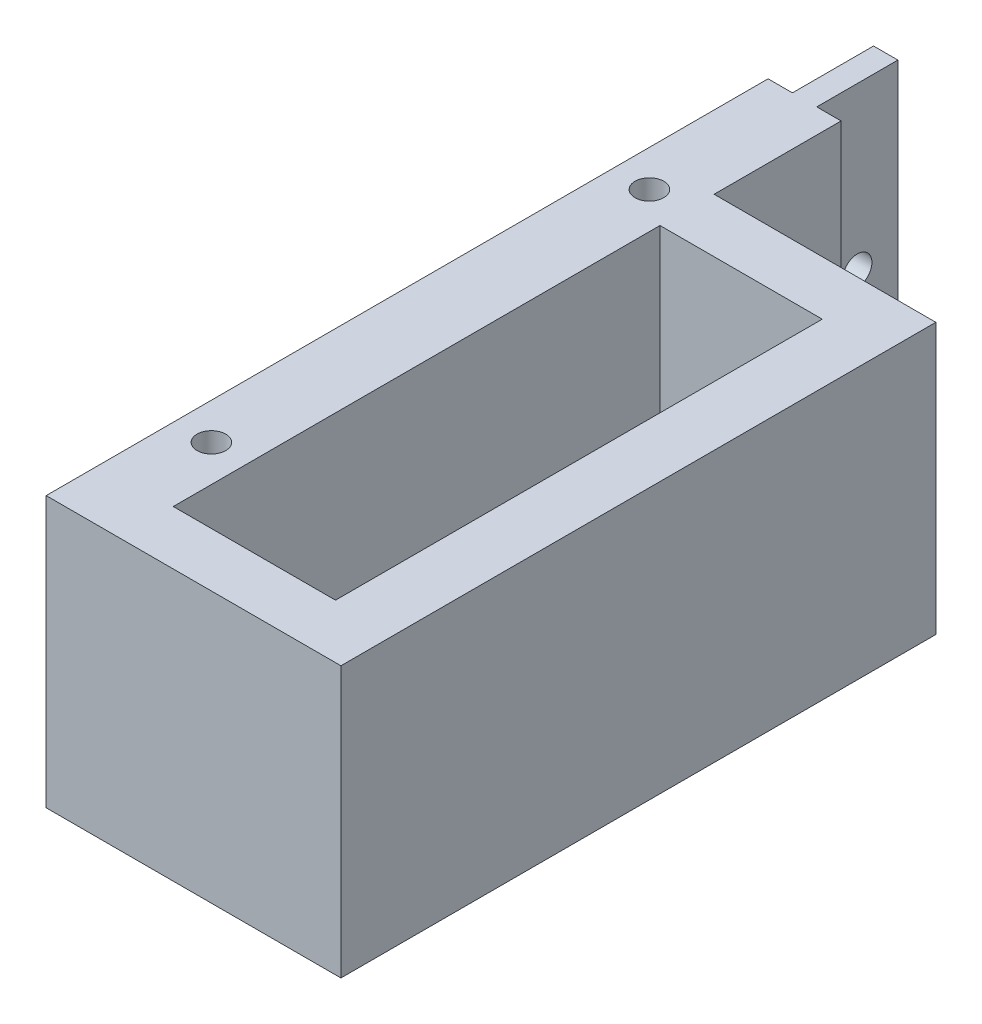
ISO-10303-21;
HEADER;
FILE_DESCRIPTION(('STEP AP214'),'2;1');
FILE_NAME('part.step','',(''),(''),'','','');
FILE_SCHEMA(('AUTOMOTIVE_DESIGN { 1 0 10303 214 1 1 1 1 }'));
ENDSEC;
DATA;
#1=APPLICATION_CONTEXT('core data for automotive mechanical design processes');
#2=APPLICATION_PROTOCOL_DEFINITION('international standard','automotive_design',2000,#1);
#3=PRODUCT_CONTEXT('',#1,'mechanical');
#4=PRODUCT('Part','Part','',(#3));
#5=PRODUCT_RELATED_PRODUCT_CATEGORY('part','',(#4));
#6=PRODUCT_DEFINITION_FORMATION('','',#4);
#7=PRODUCT_DEFINITION_CONTEXT('part definition',#1,'design');
#8=PRODUCT_DEFINITION('design','',#6,#7);
#9=PRODUCT_DEFINITION_SHAPE('','',#8);
#10=(LENGTH_UNIT() NAMED_UNIT(*) SI_UNIT(.MILLI.,.METRE.));
#11=(NAMED_UNIT(*) PLANE_ANGLE_UNIT() SI_UNIT($,.RADIAN.));
#12=(NAMED_UNIT(*) SI_UNIT($,.STERADIAN.) SOLID_ANGLE_UNIT());
#13=UNCERTAINTY_MEASURE_WITH_UNIT(LENGTH_MEASURE(1.E-05),#10,'distance_accuracy_value','');
#14=(GEOMETRIC_REPRESENTATION_CONTEXT(3) GLOBAL_UNCERTAINTY_ASSIGNED_CONTEXT((#13)) GLOBAL_UNIT_ASSIGNED_CONTEXT((#10,
#11,#12)) REPRESENTATION_CONTEXT('',''));
#15=CARTESIAN_POINT('',(0.,0.,0.));
#16=DIRECTION('',(0.,0.,1.));
#17=DIRECTION('',(1.,0.,0.));
#18=AXIS2_PLACEMENT_3D('',#15,#16,#17);
#19=CARTESIAN_POINT('',(-33.5,85.,-320.01));
#20=DIRECTION('',(0.,-1.,0.));
#21=DIRECTION('',(0.,0.,-1.));
#22=AXIS2_PLACEMENT_3D('',#19,#20,#21);
#23=PLANE('',#22);
#24=DIRECTION('',(0.,0.,1.));
#25=VECTOR('',#24,1.);
#26=CARTESIAN_POINT('',(-33.5,85.,0.));
#27=LINE('',#26,#25);
#28=CARTESIAN_POINT('',(-33.5,85.,186.515436219675));
#29=VERTEX_POINT('',#28);
#30=CARTESIAN_POINT('',(-33.5,85.,320.));
#31=VERTEX_POINT('',#30);
#32=EDGE_CURVE('E248',#29,#31,#27,.T.);
#33=ORIENTED_EDGE('',*,*,#32,.F.);
#34=DIRECTION('',(1.,0.,0.));
#35=VECTOR('',#34,1.);
#36=CARTESIAN_POINT('',(-29.,85.,186.515436219675));
#37=LINE('',#36,#35);
#38=CARTESIAN_POINT('',(-29.,85.,186.515436219675));
#39=VERTEX_POINT('',#38);
#40=EDGE_CURVE('E266',#29,#39,#37,.T.);
#41=ORIENTED_EDGE('',*,*,#40,.T.);
#42=DIRECTION('',(0.,0.,-1.));
#43=VECTOR('',#42,1.);
#44=CARTESIAN_POINT('',(-29.,85.,186.515436219675));
#45=LINE('',#44,#43);
#46=CARTESIAN_POINT('',(-29.,85.,171.515436219675));
#47=VERTEX_POINT('',#46);
#48=EDGE_CURVE('E254',#39,#47,#45,.T.);
#49=ORIENTED_EDGE('',*,*,#48,.T.);
#50=DIRECTION('',(1.,0.,0.));
#51=VECTOR('',#50,1.);
#52=CARTESIAN_POINT('',(-29.,85.,171.515436219675));
#53=LINE('',#52,#51);
#54=CARTESIAN_POINT('',(-24.5,85.,171.515436219675));
#55=VERTEX_POINT('',#54);
#56=EDGE_CURVE('E263',#47,#55,#53,.T.);
#57=ORIENTED_EDGE('',*,*,#56,.T.);
#58=DIRECTION('',(0.,0.,1.));
#59=VECTOR('',#58,1.);
#60=CARTESIAN_POINT('',(-24.5,85.,171.515436219675));
#61=LINE('',#60,#59);
#62=CARTESIAN_POINT('',(-24.5,85.,186.515436219675));
#63=VERTEX_POINT('',#62);
#64=EDGE_CURVE('E257',#55,#63,#61,.T.);
#65=ORIENTED_EDGE('',*,*,#64,.T.);
#66=DIRECTION('',(1.,0.,0.));
#67=VECTOR('',#66,1.);
#68=CARTESIAN_POINT('',(-24.5,85.,186.515436219675));
#69=LINE('',#68,#67);
#70=CARTESIAN_POINT('',(-20.,85.,186.515436219675));
#71=VERTEX_POINT('',#70);
#72=EDGE_CURVE('E260',#63,#71,#69,.T.);
#73=ORIENTED_EDGE('',*,*,#72,.T.);
#74=DIRECTION('',(0.,0.,-1.));
#75=VECTOR('',#74,1.);
#76=CARTESIAN_POINT('',(-20.,85.,0.));
#77=LINE('',#76,#75);
#78=CARTESIAN_POINT('',(-20.,85.,210.));
#79=VERTEX_POINT('',#78);
#80=EDGE_CURVE('E252',#79,#71,#77,.T.);
#81=ORIENTED_EDGE('',*,*,#80,.F.);
#82=DIRECTION('',(1.,0.,0.));
#83=VECTOR('',#82,1.);
#84=CARTESIAN_POINT('',(20.,85.,210.));
#85=LINE('',#84,#83);
#86=CARTESIAN_POINT('',(21.,85.,210.));
#87=VERTEX_POINT('',#86);
#88=EDGE_CURVE('E272',#79,#87,#85,.T.);
#89=ORIENTED_EDGE('',*,*,#88,.T.);
#90=DIRECTION('',(0.,0.,-1.));
#91=VECTOR('',#90,1.);
#92=CARTESIAN_POINT('',(21.,85.,0.));
#93=LINE('',#92,#91);
#94=CARTESIAN_POINT('',(21.,85.,320.));
#95=VERTEX_POINT('',#94);
#96=EDGE_CURVE('E250',#95,#87,#93,.T.);
#97=ORIENTED_EDGE('',*,*,#96,.F.);
#98=DIRECTION('',(-1.,0.,0.));
#99=VECTOR('',#98,1.);
#100=CARTESIAN_POINT('',(-33.5,85.,320.));
#101=LINE('',#100,#99);
#102=EDGE_CURVE('E163',#95,#31,#101,.T.);
#103=ORIENTED_EDGE('',*,*,#102,.T.);
#104=EDGE_LOOP('',(#33,#41,#49,#57,#65,#73,#81,#89,#97,#103));
#105=FACE_BOUND('',#104,.T.);
#106=DIRECTION('',(-1.,0.,0.));
#107=VECTOR('',#106,1.);
#108=CARTESIAN_POINT('',(-20.,85.,220.));
#109=LINE('',#108,#107);
#110=CARTESIAN_POINT('',(10.,85.,220.));
#111=VERTEX_POINT('',#110);
#112=CARTESIAN_POINT('',(-20.,85.,220.));
#113=VERTEX_POINT('',#112);
#114=EDGE_CURVE('E158',#111,#113,#109,.T.);
#115=ORIENTED_EDGE('',*,*,#114,.T.);
#116=DIRECTION('',(0.,0.,1.));
#117=VECTOR('',#116,1.);
#118=CARTESIAN_POINT('',(-20.,85.,220.));
#119=LINE('',#118,#117);
#120=CARTESIAN_POINT('',(-20.,85.,310.));
#121=VERTEX_POINT('',#120);
#122=EDGE_CURVE('E269',#113,#121,#119,.T.);
#123=ORIENTED_EDGE('',*,*,#122,.T.);
#124=DIRECTION('',(1.,0.,0.));
#125=VECTOR('',#124,1.);
#126=CARTESIAN_POINT('',(-20.,85.,310.));
#127=LINE('',#126,#125);
#128=CARTESIAN_POINT('',(10.,85.,310.));
#129=VERTEX_POINT('',#128);
#130=EDGE_CURVE('E168',#121,#129,#127,.T.);
#131=ORIENTED_EDGE('',*,*,#130,.T.);
#132=DIRECTION('',(0.,0.,-1.));
#133=VECTOR('',#132,1.);
#134=CARTESIAN_POINT('',(10.,85.,310.));
#135=LINE('',#134,#133);
#136=EDGE_CURVE('E148',#129,#111,#135,.T.);
#137=ORIENTED_EDGE('',*,*,#136,.T.);
#138=EDGE_LOOP('',(#115,#123,#131,#137));
#139=FACE_BOUND('',#138,.T.);
#140=CARTESIAN_POINT('',(-26.75,85.,215.21355987266));
#141=DIRECTION('',(0.,-1.,0.));
#142=DIRECTION('',(0.,0.,-1.));
#143=AXIS2_PLACEMENT_3D('',#140,#141,#142);
#144=CIRCLE('',#143,2.65);
#145=CARTESIAN_POINT('',(-26.75,85.,212.56355987266));
#146=VERTEX_POINT('',#145);
#147=EDGE_CURVE('E176',#146,#146,#144,.T.);
#148=ORIENTED_EDGE('',*,*,#147,.F.);
#149=EDGE_LOOP('',(#148));
#150=FACE_BOUND('',#149,.T.);
#151=CARTESIAN_POINT('',(-26.75,85.,296.200419438666));
#152=DIRECTION('',(0.,-1.,0.));
#153=DIRECTION('',(0.,0.,-1.));
#154=AXIS2_PLACEMENT_3D('',#151,#152,#153);
#155=CIRCLE('',#154,2.65);
#156=CARTESIAN_POINT('',(-26.75,85.,293.550419438666));
#157=VERTEX_POINT('',#156);
#158=EDGE_CURVE('E245',#157,#157,#155,.T.);
#159=ORIENTED_EDGE('',*,*,#158,.F.);
#160=EDGE_LOOP('',(#159));
#161=FACE_BOUND('',#160,.T.);
#162=ADVANCED_FACE('F38',(#105,#139,#150,#161),#23,.T.);
#163=CARTESIAN_POINT('',(-33.5,105.,179.015436219675));
#164=DIRECTION('',(1.,0.,0.));
#165=DIRECTION('',(0.,0.,-1.));
#166=AXIS2_PLACEMENT_3D('',#163,#164,#165);
#167=CYLINDRICAL_SURFACE('',#166,2.70000000000001);
#168=CARTESIAN_POINT('',(-29.,105.,179.015436219675));
#169=DIRECTION('',(1.,0.,0.));
#170=DIRECTION('',(0.,0.,-1.));
#171=AXIS2_PLACEMENT_3D('',#168,#169,#170);
#172=CIRCLE('',#171,2.70000000000001);
#173=CARTESIAN_POINT('',(-29.,105.,176.315436219675));
#174=VERTEX_POINT('',#173);
#175=EDGE_CURVE('E193',#174,#174,#172,.F.);
#176=ORIENTED_EDGE('',*,*,#175,.T.);
#177=EDGE_LOOP('',(#176));
#178=FACE_BOUND('',#177,.T.);
#179=CARTESIAN_POINT('',(-24.5,105.,179.015436219675));
#180=DIRECTION('',(-1.,0.,0.));
#181=DIRECTION('',(0.,0.,1.));
#182=AXIS2_PLACEMENT_3D('',#179,#180,#181);
#183=CIRCLE('',#182,2.70000000000001);
#184=CARTESIAN_POINT('',(-24.5,105.,181.715436219675));
#185=VERTEX_POINT('',#184);
#186=EDGE_CURVE('E211',#185,#185,#183,.F.);
#187=ORIENTED_EDGE('',*,*,#186,.T.);
#188=EDGE_LOOP('',(#187));
#189=FACE_BOUND('',#188,.T.);
#190=ADVANCED_FACE('F317',(#178,#189),#167,.F.);
#191=CARTESIAN_POINT('',(-29.,-135.01,186.515436219675));
#192=DIRECTION('',(1.,0.,0.));
#193=DIRECTION('',(0.,0.,-1.));
#194=AXIS2_PLACEMENT_3D('',#191,#192,#193);
#195=PLANE('',#194);
#196=ORIENTED_EDGE('',*,*,#175,.F.);
#197=EDGE_LOOP('',(#196));
#198=FACE_BOUND('',#197,.T.);
#199=ORIENTED_EDGE('',*,*,#48,.F.);
#200=DIRECTION('',(0.,1.,0.));
#201=VECTOR('',#200,1.);
#202=CARTESIAN_POINT('',(-29.,-135.01,186.515436219675));
#203=LINE('',#202,#201);
#204=CARTESIAN_POINT('',(-29.,135.,186.515436219675));
#205=VERTEX_POINT('',#204);
#206=EDGE_CURVE('E195',#39,#205,#203,.T.);
#207=ORIENTED_EDGE('',*,*,#206,.T.);
#208=DIRECTION('',(0.,0.,-1.));
#209=VECTOR('',#208,1.);
#210=CARTESIAN_POINT('',(-29.,135.,-320.));
#211=LINE('',#210,#209);
#212=CARTESIAN_POINT('',(-29.,135.,171.515436219675));
#213=VERTEX_POINT('',#212);
#214=EDGE_CURVE('E218',#205,#213,#211,.T.);
#215=ORIENTED_EDGE('',*,*,#214,.T.);
#216=DIRECTION('',(0.,1.,0.));
#217=VECTOR('',#216,1.);
#218=CARTESIAN_POINT('',(-29.,-135.01,171.515436219675));
#219=LINE('',#218,#217);
#220=EDGE_CURVE('E198',#47,#213,#219,.T.);
#221=ORIENTED_EDGE('',*,*,#220,.F.);
#222=EDGE_LOOP('',(#199,#207,#215,#221));
#223=FACE_BOUND('',#222,.T.);
#224=ADVANCED_FACE('F293',(#198,#223),#195,.F.);
#225=CARTESIAN_POINT('',(-29.,-135.01,171.515436219675));
#226=DIRECTION('',(0.,0.,1.));
#227=DIRECTION('',(0.,-1.,0.));
#228=AXIS2_PLACEMENT_3D('',#225,#226,#227);
#229=PLANE('',#228);
#230=ORIENTED_EDGE('',*,*,#56,.F.);
#231=ORIENTED_EDGE('',*,*,#220,.T.);
#232=DIRECTION('',(1.,0.,0.));
#233=VECTOR('',#232,1.);
#234=CARTESIAN_POINT('',(-10.,135.,171.515436219675));
#235=LINE('',#234,#233);
#236=CARTESIAN_POINT('',(-24.5,135.,171.515436219675));
#237=VERTEX_POINT('',#236);
#238=EDGE_CURVE('E221',#213,#237,#235,.T.);
#239=ORIENTED_EDGE('',*,*,#238,.T.);
#240=DIRECTION('',(0.,1.,0.));
#241=VECTOR('',#240,1.);
#242=CARTESIAN_POINT('',(-24.5,-135.01,171.515436219675));
#243=LINE('',#242,#241);
#244=EDGE_CURVE('E199',#55,#237,#243,.T.);
#245=ORIENTED_EDGE('',*,*,#244,.F.);
#246=EDGE_LOOP('',(#230,#231,#239,#245));
#247=FACE_BOUND('',#246,.T.);
#248=ADVANCED_FACE('F296',(#247),#229,.F.);
#249=CARTESIAN_POINT('',(-24.5,-135.01,171.515436219675));
#250=DIRECTION('',(-1.,0.,0.));
#251=DIRECTION('',(0.,0.,1.));
#252=AXIS2_PLACEMENT_3D('',#249,#250,#251);
#253=PLANE('',#252);
#254=ORIENTED_EDGE('',*,*,#186,.F.);
#255=EDGE_LOOP('',(#254));
#256=FACE_BOUND('',#255,.T.);
#257=ORIENTED_EDGE('',*,*,#64,.F.);
#258=ORIENTED_EDGE('',*,*,#244,.T.);
#259=DIRECTION('',(0.,0.,1.));
#260=VECTOR('',#259,1.);
#261=CARTESIAN_POINT('',(-24.5000000000001,135.,-320.));
#262=LINE('',#261,#260);
#263=CARTESIAN_POINT('',(-24.5,135.,186.515436219675));
#264=VERTEX_POINT('',#263);
#265=EDGE_CURVE('E224',#237,#264,#262,.T.);
#266=ORIENTED_EDGE('',*,*,#265,.T.);
#267=DIRECTION('',(0.,1.,0.));
#268=VECTOR('',#267,1.);
#269=CARTESIAN_POINT('',(-24.5,-135.01,186.515436219675));
#270=LINE('',#269,#268);
#271=EDGE_CURVE('E42',#63,#264,#270,.T.);
#272=ORIENTED_EDGE('',*,*,#271,.F.);
#273=EDGE_LOOP('',(#257,#258,#266,#272));
#274=FACE_BOUND('',#273,.T.);
#275=ADVANCED_FACE('F297',(#256,#274),#253,.F.);
#276=CARTESIAN_POINT('',(-24.5,-135.01,186.515436219675));
#277=DIRECTION('',(0.,0.,1.));
#278=DIRECTION('',(0.,-1.,0.));
#279=AXIS2_PLACEMENT_3D('',#276,#277,#278);
#280=PLANE('',#279);
#281=ORIENTED_EDGE('',*,*,#72,.F.);
#282=ORIENTED_EDGE('',*,*,#271,.T.);
#283=DIRECTION('',(1.,0.,0.));
#284=VECTOR('',#283,1.);
#285=CARTESIAN_POINT('',(-10.,135.,186.515436219675));
#286=LINE('',#285,#284);
#287=CARTESIAN_POINT('',(-20.,135.,186.515436219675));
#288=VERTEX_POINT('',#287);
#289=EDGE_CURVE('E196',#264,#288,#286,.T.);
#290=ORIENTED_EDGE('',*,*,#289,.T.);
#291=DIRECTION('',(0.,-1.,0.));
#292=VECTOR('',#291,1.);
#293=CARTESIAN_POINT('',(-20.,0.,186.515436219675));
#294=LINE('',#293,#292);
#295=EDGE_CURVE('E63',#288,#71,#294,.T.);
#296=ORIENTED_EDGE('',*,*,#295,.T.);
#297=EDGE_LOOP('',(#281,#282,#290,#296));
#298=FACE_BOUND('',#297,.T.);
#299=ADVANCED_FACE('F299',(#298),#280,.F.);
#300=CARTESIAN_POINT('',(-20.,0.,0.));
#301=DIRECTION('',(1.,0.,0.));
#302=DIRECTION('',(0.,0.,-1.));
#303=AXIS2_PLACEMENT_3D('',#300,#301,#302);
#304=PLANE('',#303);
#305=DIRECTION('',(0.,1.,0.));
#306=VECTOR('',#305,1.);
#307=CARTESIAN_POINT('',(-20.,135.,210.));
#308=LINE('',#307,#306);
#309=CARTESIAN_POINT('',(-20.,135.,210.));
#310=VERTEX_POINT('',#309);
#311=EDGE_CURVE('E184',#79,#310,#308,.T.);
#312=ORIENTED_EDGE('',*,*,#311,.F.);
#313=ORIENTED_EDGE('',*,*,#80,.T.);
#314=ORIENTED_EDGE('',*,*,#295,.F.);
#315=DIRECTION('',(0.,0.,1.));
#316=VECTOR('',#315,1.);
#317=CARTESIAN_POINT('',(-20.,135.,320.));
#318=LINE('',#317,#316);
#319=EDGE_CURVE('E214',#288,#310,#318,.T.);
#320=ORIENTED_EDGE('',*,*,#319,.T.);
#321=EDGE_LOOP('',(#312,#313,#314,#320));
#322=FACE_BOUND('',#321,.T.);
#323=ADVANCED_FACE('F303',(#322),#304,.T.);
#324=CARTESIAN_POINT('',(-20.,-135.,220.));
#325=DIRECTION('',(-1.,0.,0.));
#326=DIRECTION('',(0.,0.,1.));
#327=AXIS2_PLACEMENT_3D('',#324,#325,#326);
#328=PLANE('',#327);
#329=ORIENTED_EDGE('',*,*,#122,.F.);
#330=DIRECTION('',(0.,1.,0.));
#331=VECTOR('',#330,1.);
#332=CARTESIAN_POINT('',(-20.,-135.,220.));
#333=LINE('',#332,#331);
#334=CARTESIAN_POINT('',(-20.,135.,220.));
#335=VERTEX_POINT('',#334);
#336=EDGE_CURVE('E154',#113,#335,#333,.T.);
#337=ORIENTED_EDGE('',*,*,#336,.T.);
#338=DIRECTION('',(0.,0.,1.));
#339=VECTOR('',#338,1.);
#340=CARTESIAN_POINT('',(-20.,135.,220.));
#341=LINE('',#340,#339);
#342=CARTESIAN_POINT('',(-20.,135.,310.));
#343=VERTEX_POINT('',#342);
#344=EDGE_CURVE('E179',#335,#343,#341,.T.);
#345=ORIENTED_EDGE('',*,*,#344,.T.);
#346=DIRECTION('',(0.,1.,0.));
#347=VECTOR('',#346,1.);
#348=CARTESIAN_POINT('',(-20.,-135.,310.));
#349=LINE('',#348,#347);
#350=EDGE_CURVE('E182',#121,#343,#349,.T.);
#351=ORIENTED_EDGE('',*,*,#350,.F.);
#352=EDGE_LOOP('',(#329,#337,#345,#351));
#353=FACE_BOUND('',#352,.T.);
#354=ADVANCED_FACE('F341',(#353),#328,.F.);
#355=CARTESIAN_POINT('',(-20.,-135.,220.));
#356=DIRECTION('',(0.,0.,-1.));
#357=DIRECTION('',(0.,1.,0.));
#358=AXIS2_PLACEMENT_3D('',#355,#356,#357);
#359=PLANE('',#358);
#360=ORIENTED_EDGE('',*,*,#114,.F.);
#361=DIRECTION('',(0.,1.,0.));
#362=VECTOR('',#361,1.);
#363=CARTESIAN_POINT('',(10.,-135.,220.));
#364=LINE('',#363,#362);
#365=CARTESIAN_POINT('',(10.,135.,220.));
#366=VERTEX_POINT('',#365);
#367=EDGE_CURVE('E144',#111,#366,#364,.T.);
#368=ORIENTED_EDGE('',*,*,#367,.T.);
#369=DIRECTION('',(-1.,0.,0.));
#370=VECTOR('',#369,1.);
#371=CARTESIAN_POINT('',(-20.,135.,220.));
#372=LINE('',#371,#370);
#373=EDGE_CURVE('E236',#366,#335,#372,.T.);
#374=ORIENTED_EDGE('',*,*,#373,.T.);
#375=ORIENTED_EDGE('',*,*,#336,.F.);
#376=EDGE_LOOP('',(#360,#368,#374,#375));
#377=FACE_BOUND('',#376,.T.);
#378=ADVANCED_FACE('F159',(#377),#359,.F.);
#379=CARTESIAN_POINT('',(-10.,135.,-320.));
#380=DIRECTION('',(0.,1.,0.));
#381=DIRECTION('',(0.,0.,1.));
#382=AXIS2_PLACEMENT_3D('',#379,#380,#381);
#383=PLANE('',#382);
#384=CARTESIAN_POINT('',(-26.75,135.,215.21355987266));
#385=DIRECTION('',(0.,1.,0.));
#386=DIRECTION('',(0.,0.,1.));
#387=AXIS2_PLACEMENT_3D('',#384,#385,#386);
#388=CIRCLE('',#387,2.65);
#389=CARTESIAN_POINT('',(-26.75,135.,212.56355987266));
#390=VERTEX_POINT('',#389);
#391=EDGE_CURVE('E47',#390,#390,#388,.F.);
#392=ORIENTED_EDGE('',*,*,#391,.T.);
#393=EDGE_LOOP('',(#392));
#394=FACE_BOUND('',#393,.T.);
#395=CARTESIAN_POINT('',(-26.75,135.,296.200419438666));
#396=DIRECTION('',(0.,1.,0.));
#397=DIRECTION('',(0.,0.,1.));
#398=AXIS2_PLACEMENT_3D('',#395,#396,#397);
#399=CIRCLE('',#398,2.65);
#400=CARTESIAN_POINT('',(-26.75,135.,293.550419438666));
#401=VERTEX_POINT('',#400);
#402=EDGE_CURVE('E11',#401,#401,#399,.F.);
#403=ORIENTED_EDGE('',*,*,#402,.T.);
#404=EDGE_LOOP('',(#403));
#405=FACE_BOUND('',#404,.T.);
#406=DIRECTION('',(1.,0.,0.));
#407=VECTOR('',#406,1.);
#408=CARTESIAN_POINT('',(-9.99999999999688,135.,186.515436219675));
#409=LINE('',#408,#407);
#410=CARTESIAN_POINT('',(-33.5,135.,186.515436219675));
#411=VERTEX_POINT('',#410);
#412=EDGE_CURVE('E192',#411,#205,#409,.T.);
#413=ORIENTED_EDGE('',*,*,#412,.F.);
#414=DIRECTION('',(0.,0.,-1.));
#415=VECTOR('',#414,1.);
#416=CARTESIAN_POINT('',(-33.5,135.,0.));
#417=LINE('',#416,#415);
#418=CARTESIAN_POINT('',(-33.5,135.,320.));
#419=VERTEX_POINT('',#418);
#420=EDGE_CURVE('E190',#419,#411,#417,.T.);
#421=ORIENTED_EDGE('',*,*,#420,.F.);
#422=DIRECTION('',(1.,0.,0.));
#423=VECTOR('',#422,1.);
#424=CARTESIAN_POINT('',(-33.5,135.,320.));
#425=LINE('',#424,#423);
#426=CARTESIAN_POINT('',(21.,135.,320.));
#427=VERTEX_POINT('',#426);
#428=EDGE_CURVE('E189',#419,#427,#425,.T.);
#429=ORIENTED_EDGE('',*,*,#428,.T.);
#430=DIRECTION('',(0.,0.,1.));
#431=VECTOR('',#430,1.);
#432=CARTESIAN_POINT('',(21.,135.,320.));
#433=LINE('',#432,#431);
#434=CARTESIAN_POINT('',(21.,135.,210.));
#435=VERTEX_POINT('',#434);
#436=EDGE_CURVE('E178',#435,#427,#433,.T.);
#437=ORIENTED_EDGE('',*,*,#436,.F.);
#438=DIRECTION('',(-1.,0.,0.));
#439=VECTOR('',#438,1.);
#440=CARTESIAN_POINT('',(20.,135.,210.));
#441=LINE('',#440,#439);
#442=EDGE_CURVE('E186',#435,#310,#441,.T.);
#443=ORIENTED_EDGE('',*,*,#442,.T.);
#444=ORIENTED_EDGE('',*,*,#319,.F.);
#445=ORIENTED_EDGE('',*,*,#289,.F.);
#446=ORIENTED_EDGE('',*,*,#265,.F.);
#447=ORIENTED_EDGE('',*,*,#238,.F.);
#448=ORIENTED_EDGE('',*,*,#214,.F.);
#449=EDGE_LOOP('',(#413,#421,#429,#437,#443,#444,#445,#446,#447,#448));
#450=FACE_BOUND('',#449,.T.);
#451=DIRECTION('',(1.,0.,0.));
#452=VECTOR('',#451,1.);
#453=CARTESIAN_POINT('',(-20.,135.,310.));
#454=LINE('',#453,#452);
#455=CARTESIAN_POINT('',(10.,135.,310.));
#456=VERTEX_POINT('',#455);
#457=EDGE_CURVE('E232',#343,#456,#454,.T.);
#458=ORIENTED_EDGE('',*,*,#457,.F.);
#459=ORIENTED_EDGE('',*,*,#344,.F.);
#460=ORIENTED_EDGE('',*,*,#373,.F.);
#461=DIRECTION('',(0.,0.,-1.));
#462=VECTOR('',#461,1.);
#463=CARTESIAN_POINT('',(10.,135.,310.));
#464=LINE('',#463,#462);
#465=EDGE_CURVE('E150',#456,#366,#464,.T.);
#466=ORIENTED_EDGE('',*,*,#465,.F.);
#467=EDGE_LOOP('',(#458,#459,#460,#466));
#468=FACE_BOUND('',#467,.T.);
#469=ADVANCED_FACE('F285',(#394,#405,#450,#468),#383,.T.);
#470=CARTESIAN_POINT('',(-26.75,135.000012,215.21355987266));
#471=DIRECTION('',(0.,-1.,0.));
#472=DIRECTION('',(0.,0.,-1.));
#473=AXIS2_PLACEMENT_3D('',#470,#471,#472);
#474=CYLINDRICAL_SURFACE('',#473,2.65);
#475=CARTESIAN_POINT('',(-26.75,135.,212.56355987266));
#476=CARTESIAN_POINT('',(-26.75,134.479166666667,212.56355987266));
#477=CARTESIAN_POINT('',(-26.75,133.958333333333,212.56355987266));
#478=CARTESIAN_POINT('',(-26.75,132.916666666667,212.56355987266));
#479=CARTESIAN_POINT('',(-26.75,132.395833333333,212.56355987266));
#480=CARTESIAN_POINT('',(-26.75,131.354166666667,212.56355987266));
#481=CARTESIAN_POINT('',(-26.75,130.833333333333,212.56355987266));
#482=CARTESIAN_POINT('',(-26.75,129.791666666667,212.56355987266));
#483=CARTESIAN_POINT('',(-26.75,129.270833333333,212.56355987266));
#484=CARTESIAN_POINT('',(-26.75,128.229166666667,212.56355987266));
#485=CARTESIAN_POINT('',(-26.75,127.708333333333,212.56355987266));
#486=CARTESIAN_POINT('',(-26.75,126.666666666667,212.56355987266));
#487=CARTESIAN_POINT('',(-26.75,126.145833333333,212.56355987266));
#488=CARTESIAN_POINT('',(-26.75,125.104166666667,212.56355987266));
#489=CARTESIAN_POINT('',(-26.75,124.583333333333,212.56355987266));
#490=CARTESIAN_POINT('',(-26.75,123.541666666667,212.56355987266));
#491=CARTESIAN_POINT('',(-26.75,123.020833333333,212.56355987266));
#492=CARTESIAN_POINT('',(-26.75,121.979166666667,212.56355987266));
#493=CARTESIAN_POINT('',(-26.75,121.458333333333,212.56355987266));
#494=CARTESIAN_POINT('',(-26.75,120.416666666667,212.56355987266));
#495=CARTESIAN_POINT('',(-26.75,119.895833333333,212.56355987266));
#496=CARTESIAN_POINT('',(-26.75,118.854166666667,212.56355987266));
#497=CARTESIAN_POINT('',(-26.75,118.333333333333,212.56355987266));
#498=CARTESIAN_POINT('',(-26.75,117.291666666667,212.56355987266));
#499=CARTESIAN_POINT('',(-26.75,116.770833333333,212.56355987266));
#500=CARTESIAN_POINT('',(-26.75,115.729166666667,212.56355987266));
#501=CARTESIAN_POINT('',(-26.75,115.208333333333,212.56355987266));
#502=CARTESIAN_POINT('',(-26.75,114.166666666667,212.56355987266));
#503=CARTESIAN_POINT('',(-26.75,113.645833333333,212.56355987266));
#504=CARTESIAN_POINT('',(-26.75,112.604166666667,212.56355987266));
#505=CARTESIAN_POINT('',(-26.75,112.083333333333,212.56355987266));
#506=CARTESIAN_POINT('',(-26.75,111.041666666667,212.56355987266));
#507=CARTESIAN_POINT('',(-26.75,110.520833333333,212.56355987266));
#508=CARTESIAN_POINT('',(-26.75,109.479166666667,212.56355987266));
#509=CARTESIAN_POINT('',(-26.75,108.958333333333,212.56355987266));
#510=CARTESIAN_POINT('',(-26.75,107.916666666667,212.56355987266));
#511=CARTESIAN_POINT('',(-26.75,107.395833333333,212.56355987266));
#512=CARTESIAN_POINT('',(-26.75,106.354166666667,212.56355987266));
#513=CARTESIAN_POINT('',(-26.75,105.833333333333,212.56355987266));
#514=CARTESIAN_POINT('',(-26.75,104.791666666667,212.56355987266));
#515=CARTESIAN_POINT('',(-26.75,104.270833333333,212.56355987266));
#516=CARTESIAN_POINT('',(-26.75,103.229166666667,212.56355987266));
#517=CARTESIAN_POINT('',(-26.75,102.708333333333,212.56355987266));
#518=CARTESIAN_POINT('',(-26.75,101.666666666667,212.56355987266));
#519=CARTESIAN_POINT('',(-26.75,101.145833333333,212.56355987266));
#520=CARTESIAN_POINT('',(-26.75,100.104166666667,212.56355987266));
#521=CARTESIAN_POINT('',(-26.75,99.5833333333333,212.56355987266));
#522=CARTESIAN_POINT('',(-26.75,98.5416666666666,212.56355987266));
#523=CARTESIAN_POINT('',(-26.75,98.0208333333333,212.56355987266));
#524=CARTESIAN_POINT('',(-26.75,96.9791666666666,212.56355987266));
#525=CARTESIAN_POINT('',(-26.75,96.4583333333333,212.56355987266));
#526=CARTESIAN_POINT('',(-26.75,95.4166666666666,212.56355987266));
#527=CARTESIAN_POINT('',(-26.75,94.8958333333333,212.56355987266));
#528=CARTESIAN_POINT('',(-26.75,93.8541666666666,212.56355987266));
#529=CARTESIAN_POINT('',(-26.75,93.3333333333333,212.56355987266));
#530=CARTESIAN_POINT('',(-26.75,92.2916666666666,212.56355987266));
#531=CARTESIAN_POINT('',(-26.75,91.7708333333333,212.56355987266));
#532=CARTESIAN_POINT('',(-26.75,90.7291666666666,212.56355987266));
#533=CARTESIAN_POINT('',(-26.75,90.2083333333333,212.56355987266));
#534=CARTESIAN_POINT('',(-26.75,89.1666666666666,212.56355987266));
#535=CARTESIAN_POINT('',(-26.75,88.6458333333333,212.56355987266));
#536=CARTESIAN_POINT('',(-26.75,87.6041666666666,212.56355987266));
#537=CARTESIAN_POINT('',(-26.75,87.0833333333333,212.56355987266));
#538=CARTESIAN_POINT('',(-26.75,86.0416666666666,212.56355987266));
#539=CARTESIAN_POINT('',(-26.75,85.5208333333333,212.56355987266));
#540=CARTESIAN_POINT('',(-26.75,85.,212.56355987266));
#541=B_SPLINE_CURVE_WITH_KNOTS('',3,(#475,#476,#477,#478,#479,#480,#481,#482,#483,#484,#485,
#486,#487,#488,#489,#490,#491,#492,#493,#494,#495,#496,#497,#498,#499,#500,#501,#502,#503,#504,
#505,#506,#507,#508,#509,#510,#511,#512,#513,#514,#515,#516,#517,#518,#519,#520,#521,#522,#523,
#524,#525,#526,#527,#528,#529,#530,#531,#532,#533,#534,#535,#536,#537,#538,#539,#540),
.UNSPECIFIED.,.F.,.F.,(4,2,2,2,2,2,2,2,2,2,2,2,2,2,2,2,2,2,2,2,2,2,2,2,2,2,2,2,2,2,2,2,4),(0.,
1.56250000000002,3.12500000000002,4.68750000000001,6.25000000000001,7.8125,9.37500000000002,
10.9375,12.5,14.0625,15.625,17.1875,18.75,20.3125,21.875,23.4375,25.,26.5625,28.125,29.6875,
31.25,32.8125,34.375,35.9375,37.5,39.0625,40.625,42.1875,43.75,45.3125,46.875,48.4375,50.),.UNSPECIFIED.);
#542=EDGE_CURVE('BSEAM331',#390,#146,#541,.T.);
#543=ORIENTED_EDGE('',*,*,#391,.F.);
#544=ORIENTED_EDGE('',*,*,#147,.T.);
#545=ORIENTED_EDGE('',*,*,#542,.T.);
#546=ORIENTED_EDGE('',*,*,#542,.F.);
#547=EDGE_LOOP('',(#543,#545,#544,#546));
#548=FACE_BOUND('',#547,.T.);
#549=ADVANCED_FACE('F331',(#548),#474,.F.);
#550=CARTESIAN_POINT('',(-26.75,135.000012,296.200419438666));
#551=DIRECTION('',(0.,-1.,0.));
#552=DIRECTION('',(0.,0.,-1.));
#553=AXIS2_PLACEMENT_3D('',#550,#551,#552);
#554=CYLINDRICAL_SURFACE('',#553,2.65);
#555=CARTESIAN_POINT('',(-26.75,135.,293.550419438666));
#556=CARTESIAN_POINT('',(-26.75,134.479166666667,293.550419438666));
#557=CARTESIAN_POINT('',(-26.75,133.958333333333,293.550419438666));
#558=CARTESIAN_POINT('',(-26.75,132.916666666667,293.550419438666));
#559=CARTESIAN_POINT('',(-26.75,132.395833333333,293.550419438666));
#560=CARTESIAN_POINT('',(-26.75,131.354166666667,293.550419438666));
#561=CARTESIAN_POINT('',(-26.75,130.833333333333,293.550419438666));
#562=CARTESIAN_POINT('',(-26.75,129.791666666667,293.550419438666));
#563=CARTESIAN_POINT('',(-26.75,129.270833333333,293.550419438666));
#564=CARTESIAN_POINT('',(-26.75,128.229166666667,293.550419438666));
#565=CARTESIAN_POINT('',(-26.75,127.708333333333,293.550419438666));
#566=CARTESIAN_POINT('',(-26.75,126.666666666667,293.550419438666));
#567=CARTESIAN_POINT('',(-26.75,126.145833333333,293.550419438666));
#568=CARTESIAN_POINT('',(-26.75,125.104166666667,293.550419438666));
#569=CARTESIAN_POINT('',(-26.75,124.583333333333,293.550419438666));
#570=CARTESIAN_POINT('',(-26.75,123.541666666667,293.550419438666));
#571=CARTESIAN_POINT('',(-26.75,123.020833333333,293.550419438666));
#572=CARTESIAN_POINT('',(-26.75,121.979166666667,293.550419438666));
#573=CARTESIAN_POINT('',(-26.75,121.458333333333,293.550419438666));
#574=CARTESIAN_POINT('',(-26.75,120.416666666667,293.550419438666));
#575=CARTESIAN_POINT('',(-26.75,119.895833333333,293.550419438666));
#576=CARTESIAN_POINT('',(-26.75,118.854166666667,293.550419438666));
#577=CARTESIAN_POINT('',(-26.75,118.333333333333,293.550419438666));
#578=CARTESIAN_POINT('',(-26.75,117.291666666667,293.550419438666));
#579=CARTESIAN_POINT('',(-26.75,116.770833333333,293.550419438666));
#580=CARTESIAN_POINT('',(-26.75,115.729166666667,293.550419438666));
#581=CARTESIAN_POINT('',(-26.75,115.208333333333,293.550419438666));
#582=CARTESIAN_POINT('',(-26.75,114.166666666667,293.550419438666));
#583=CARTESIAN_POINT('',(-26.75,113.645833333333,293.550419438666));
#584=CARTESIAN_POINT('',(-26.75,112.604166666667,293.550419438666));
#585=CARTESIAN_POINT('',(-26.75,112.083333333333,293.550419438666));
#586=CARTESIAN_POINT('',(-26.75,111.041666666667,293.550419438666));
#587=CARTESIAN_POINT('',(-26.75,110.520833333333,293.550419438666));
#588=CARTESIAN_POINT('',(-26.75,109.479166666667,293.550419438666));
#589=CARTESIAN_POINT('',(-26.75,108.958333333333,293.550419438666));
#590=CARTESIAN_POINT('',(-26.75,107.916666666667,293.550419438666));
#591=CARTESIAN_POINT('',(-26.75,107.395833333333,293.550419438666));
#592=CARTESIAN_POINT('',(-26.75,106.354166666667,293.550419438666));
#593=CARTESIAN_POINT('',(-26.75,105.833333333333,293.550419438666));
#594=CARTESIAN_POINT('',(-26.75,104.791666666667,293.550419438666));
#595=CARTESIAN_POINT('',(-26.75,104.270833333333,293.550419438666));
#596=CARTESIAN_POINT('',(-26.75,103.229166666667,293.550419438666));
#597=CARTESIAN_POINT('',(-26.75,102.708333333333,293.550419438666));
#598=CARTESIAN_POINT('',(-26.75,101.666666666667,293.550419438666));
#599=CARTESIAN_POINT('',(-26.75,101.145833333333,293.550419438666));
#600=CARTESIAN_POINT('',(-26.75,100.104166666667,293.550419438666));
#601=CARTESIAN_POINT('',(-26.75,99.5833333333333,293.550419438666));
#602=CARTESIAN_POINT('',(-26.75,98.5416666666666,293.550419438666));
#603=CARTESIAN_POINT('',(-26.75,98.0208333333333,293.550419438666));
#604=CARTESIAN_POINT('',(-26.75,96.9791666666666,293.550419438666));
#605=CARTESIAN_POINT('',(-26.75,96.4583333333333,293.550419438666));
#606=CARTESIAN_POINT('',(-26.75,95.4166666666666,293.550419438666));
#607=CARTESIAN_POINT('',(-26.75,94.8958333333333,293.550419438666));
#608=CARTESIAN_POINT('',(-26.75,93.8541666666666,293.550419438666));
#609=CARTESIAN_POINT('',(-26.75,93.3333333333333,293.550419438666));
#610=CARTESIAN_POINT('',(-26.75,92.2916666666666,293.550419438666));
#611=CARTESIAN_POINT('',(-26.75,91.7708333333333,293.550419438666));
#612=CARTESIAN_POINT('',(-26.75,90.7291666666666,293.550419438666));
#613=CARTESIAN_POINT('',(-26.75,90.2083333333333,293.550419438666));
#614=CARTESIAN_POINT('',(-26.75,89.1666666666666,293.550419438666));
#615=CARTESIAN_POINT('',(-26.75,88.6458333333333,293.550419438666));
#616=CARTESIAN_POINT('',(-26.75,87.6041666666666,293.550419438666));
#617=CARTESIAN_POINT('',(-26.75,87.0833333333333,293.550419438666));
#618=CARTESIAN_POINT('',(-26.75,86.0416666666666,293.550419438666));
#619=CARTESIAN_POINT('',(-26.75,85.5208333333333,293.550419438666));
#620=CARTESIAN_POINT('',(-26.75,85.,293.550419438666));
#621=B_SPLINE_CURVE_WITH_KNOTS('',3,(#555,#556,#557,#558,#559,#560,#561,#562,#563,#564,#565,
#566,#567,#568,#569,#570,#571,#572,#573,#574,#575,#576,#577,#578,#579,#580,#581,#582,#583,#584,
#585,#586,#587,#588,#589,#590,#591,#592,#593,#594,#595,#596,#597,#598,#599,#600,#601,#602,#603,
#604,#605,#606,#607,#608,#609,#610,#611,#612,#613,#614,#615,#616,#617,#618,#619,#620),
.UNSPECIFIED.,.F.,.F.,(4,2,2,2,2,2,2,2,2,2,2,2,2,2,2,2,2,2,2,2,2,2,2,2,2,2,2,2,2,2,2,2,4),(0.,
1.56250000000002,3.12500000000002,4.68750000000001,6.25000000000001,7.8125,9.37500000000002,
10.9375,12.5,14.0625,15.625,17.1875,18.75,20.3125,21.875,23.4375,25.,26.5625,28.125,29.6875,
31.25,32.8125,34.375,35.9375,37.5,39.0625,40.625,42.1875,43.75,45.3125,46.875,48.4375,50.),.UNSPECIFIED.);
#622=EDGE_CURVE('BSEAM334',#401,#157,#621,.T.);
#623=ORIENTED_EDGE('',*,*,#402,.F.);
#624=ORIENTED_EDGE('',*,*,#158,.T.);
#625=ORIENTED_EDGE('',*,*,#622,.T.);
#626=ORIENTED_EDGE('',*,*,#622,.F.);
#627=EDGE_LOOP('',(#623,#625,#624,#626));
#628=FACE_BOUND('',#627,.T.);
#629=ADVANCED_FACE('F334',(#628),#554,.F.);
#630=CARTESIAN_POINT('',(-29.,-135.01,186.515436219675));
#631=DIRECTION('',(0.,0.,1.));
#632=DIRECTION('',(1.,0.,0.));
#633=AXIS2_PLACEMENT_3D('',#630,#631,#632);
#634=PLANE('',#633);
#635=ORIENTED_EDGE('',*,*,#40,.F.);
#636=DIRECTION('',(0.,1.,0.));
#637=VECTOR('',#636,1.);
#638=CARTESIAN_POINT('',(-33.5,0.,186.515436219675));
#639=LINE('',#638,#637);
#640=EDGE_CURVE('E55',#29,#411,#639,.T.);
#641=ORIENTED_EDGE('',*,*,#640,.T.);
#642=ORIENTED_EDGE('',*,*,#412,.T.);
#643=ORIENTED_EDGE('',*,*,#206,.F.);
#644=EDGE_LOOP('',(#635,#641,#642,#643));
#645=FACE_BOUND('',#644,.T.);
#646=ADVANCED_FACE('F290',(#645),#634,.F.);
#647=CARTESIAN_POINT('',(-33.5,0.,0.));
#648=DIRECTION('',(-1.,0.,0.));
#649=DIRECTION('',(0.,0.,1.));
#650=AXIS2_PLACEMENT_3D('',#647,#648,#649);
#651=PLANE('',#650);
#652=ORIENTED_EDGE('',*,*,#640,.F.);
#653=ORIENTED_EDGE('',*,*,#32,.T.);
#654=DIRECTION('',(0.,1.,0.));
#655=VECTOR('',#654,1.);
#656=CARTESIAN_POINT('',(-33.5,0.,320.));
#657=LINE('',#656,#655);
#658=EDGE_CURVE('E187',#31,#419,#657,.T.);
#659=ORIENTED_EDGE('',*,*,#658,.T.);
#660=ORIENTED_EDGE('',*,*,#420,.T.);
#661=EDGE_LOOP('',(#652,#653,#659,#660));
#662=FACE_BOUND('',#661,.T.);
#663=ADVANCED_FACE('F283',(#662),#651,.T.);
#664=CARTESIAN_POINT('',(-20.,-135.,310.));
#665=DIRECTION('',(0.,0.,1.));
#666=DIRECTION('',(0.,-1.,0.));
#667=AXIS2_PLACEMENT_3D('',#664,#665,#666);
#668=PLANE('',#667);
#669=ORIENTED_EDGE('',*,*,#130,.F.);
#670=ORIENTED_EDGE('',*,*,#350,.T.);
#671=ORIENTED_EDGE('',*,*,#457,.T.);
#672=DIRECTION('',(0.,1.,0.));
#673=VECTOR('',#672,1.);
#674=CARTESIAN_POINT('',(10.,-135.,310.));
#675=LINE('',#674,#673);
#676=EDGE_CURVE('E155',#129,#456,#675,.T.);
#677=ORIENTED_EDGE('',*,*,#676,.F.);
#678=EDGE_LOOP('',(#669,#670,#671,#677));
#679=FACE_BOUND('',#678,.T.);
#680=ADVANCED_FACE('F356',(#679),#668,.F.);
#681=CARTESIAN_POINT('',(10.,-135.,310.));
#682=DIRECTION('',(1.,0.,0.));
#683=DIRECTION('',(0.,0.,-1.));
#684=AXIS2_PLACEMENT_3D('',#681,#682,#683);
#685=PLANE('',#684);
#686=ORIENTED_EDGE('',*,*,#136,.F.);
#687=ORIENTED_EDGE('',*,*,#676,.T.);
#688=ORIENTED_EDGE('',*,*,#465,.T.);
#689=ORIENTED_EDGE('',*,*,#367,.F.);
#690=EDGE_LOOP('',(#686,#687,#688,#689));
#691=FACE_BOUND('',#690,.T.);
#692=ADVANCED_FACE('F146',(#691),#685,.F.);
#693=CARTESIAN_POINT('',(20.,135.,210.));
#694=DIRECTION('',(0.,0.,1.));
#695=DIRECTION('',(0.,-1.,0.));
#696=AXIS2_PLACEMENT_3D('',#693,#694,#695);
#697=PLANE('',#696);
#698=ORIENTED_EDGE('',*,*,#88,.F.);
#699=ORIENTED_EDGE('',*,*,#311,.T.);
#700=ORIENTED_EDGE('',*,*,#442,.F.);
#701=DIRECTION('',(0.,1.,0.));
#702=VECTOR('',#701,1.);
#703=CARTESIAN_POINT('',(21.,135.,210.));
#704=LINE('',#703,#702);
#705=EDGE_CURVE('E175',#87,#435,#704,.T.);
#706=ORIENTED_EDGE('',*,*,#705,.F.);
#707=EDGE_LOOP('',(#698,#699,#700,#706));
#708=FACE_BOUND('',#707,.T.);
#709=ADVANCED_FACE('F307',(#708),#697,.F.);
#710=CARTESIAN_POINT('',(21.,0.,0.));
#711=DIRECTION('',(1.,0.,0.));
#712=DIRECTION('',(0.,0.,-1.));
#713=AXIS2_PLACEMENT_3D('',#710,#711,#712);
#714=PLANE('',#713);
#715=DIRECTION('',(0.,-1.,0.));
#716=VECTOR('',#715,1.);
#717=CARTESIAN_POINT('',(21.,135.,320.));
#718=LINE('',#717,#716);
#719=EDGE_CURVE('E172',#427,#95,#718,.T.);
#720=ORIENTED_EDGE('',*,*,#719,.T.);
#721=ORIENTED_EDGE('',*,*,#96,.T.);
#722=ORIENTED_EDGE('',*,*,#705,.T.);
#723=ORIENTED_EDGE('',*,*,#436,.T.);
#724=EDGE_LOOP('',(#720,#721,#722,#723));
#725=FACE_BOUND('',#724,.T.);
#726=ADVANCED_FACE('F309',(#725),#714,.T.);
#727=CARTESIAN_POINT('',(-33.5,0.,320.));
#728=DIRECTION('',(0.,0.,-1.));
#729=DIRECTION('',(0.,1.,0.));
#730=AXIS2_PLACEMENT_3D('',#727,#728,#729);
#731=PLANE('',#730);
#732=ORIENTED_EDGE('',*,*,#102,.F.);
#733=ORIENTED_EDGE('',*,*,#719,.F.);
#734=ORIENTED_EDGE('',*,*,#428,.F.);
#735=ORIENTED_EDGE('',*,*,#658,.F.);
#736=EDGE_LOOP('',(#732,#733,#734,#735));
#737=FACE_BOUND('',#736,.T.);
#738=ADVANCED_FACE('F40',(#737),#731,.F.);
#739=CLOSED_SHELL('',(#162,#190,#224,#248,#275,#299,#323,#354,#378,#469,#549,#629,#646,#663,
#680,#692,#709,#726,#738));
#740=MANIFOLD_SOLID_BREP('B2',#739);
#741=ADVANCED_BREP_SHAPE_REPRESENTATION('',(#18,#740),#14);
#742=SHAPE_DEFINITION_REPRESENTATION(#9,#741);
ENDSEC;
END-ISO-10303-21;
